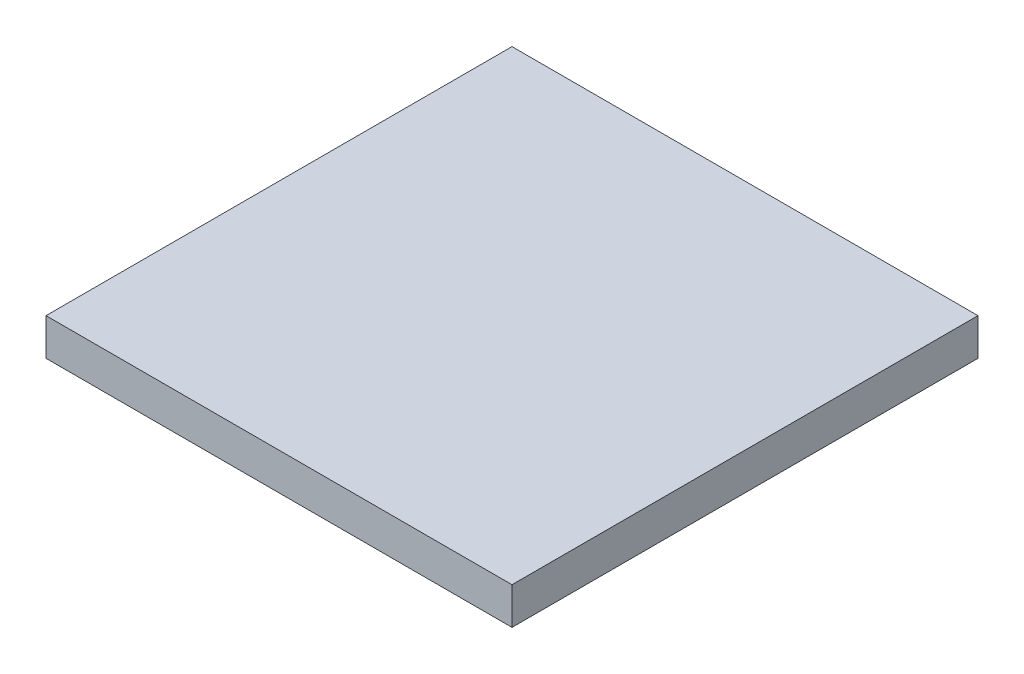
ISO-10303-21;
HEADER;
FILE_DESCRIPTION(('STEP AP214'),'2;1');
FILE_NAME('part.step','',(''),(''),'','','');
FILE_SCHEMA(('AUTOMOTIVE_DESIGN { 1 0 10303 214 1 1 1 1 }'));
ENDSEC;
DATA;
#1=APPLICATION_CONTEXT('core data for automotive mechanical design processes');
#2=APPLICATION_PROTOCOL_DEFINITION('international standard','automotive_design',2000,#1);
#3=PRODUCT_CONTEXT('',#1,'mechanical');
#4=PRODUCT('Part','Part','',(#3));
#5=PRODUCT_RELATED_PRODUCT_CATEGORY('part','',(#4));
#6=PRODUCT_DEFINITION_FORMATION('','',#4);
#7=PRODUCT_DEFINITION_CONTEXT('part definition',#1,'design');
#8=PRODUCT_DEFINITION('design','',#6,#7);
#9=PRODUCT_DEFINITION_SHAPE('','',#8);
#10=(LENGTH_UNIT() NAMED_UNIT(*) SI_UNIT(.MILLI.,.METRE.));
#11=(NAMED_UNIT(*) PLANE_ANGLE_UNIT() SI_UNIT($,.RADIAN.));
#12=(NAMED_UNIT(*) SI_UNIT($,.STERADIAN.) SOLID_ANGLE_UNIT());
#13=UNCERTAINTY_MEASURE_WITH_UNIT(LENGTH_MEASURE(1.E-05),#10,'distance_accuracy_value','');
#14=(GEOMETRIC_REPRESENTATION_CONTEXT(3) GLOBAL_UNCERTAINTY_ASSIGNED_CONTEXT((#13)) GLOBAL_UNIT_ASSIGNED_CONTEXT((#10,
#11,#12)) REPRESENTATION_CONTEXT('',''));
#15=CARTESIAN_POINT('',(0.,0.,0.));
#16=DIRECTION('',(0.,0.,1.));
#17=DIRECTION('',(1.,0.,0.));
#18=AXIS2_PLACEMENT_3D('',#15,#16,#17);
#19=CARTESIAN_POINT('',(0.,6.35,0.));
#20=DIRECTION('',(1.,0.,0.));
#21=DIRECTION('',(0.,0.,-1.));
#22=AXIS2_PLACEMENT_3D('',#19,#20,#21);
#23=PLANE('',#22);
#24=DIRECTION('',(0.,0.,1.));
#25=VECTOR('',#24,1.);
#26=CARTESIAN_POINT('',(0.,0.,0.));
#27=LINE('',#26,#25);
#28=CARTESIAN_POINT('',(0.,0.,0.));
#29=VERTEX_POINT('',#28);
#30=CARTESIAN_POINT('',(0.,0.,80.01));
#31=VERTEX_POINT('',#30);
#32=EDGE_CURVE('E96',#29,#31,#27,.T.);
#33=ORIENTED_EDGE('',*,*,#32,.T.);
#34=DIRECTION('',(0.,-1.,0.));
#35=VECTOR('',#34,1.);
#36=CARTESIAN_POINT('',(0.,6.35,80.01));
#37=LINE('',#36,#35);
#38=CARTESIAN_POINT('',(0.,6.35,80.01));
#39=VERTEX_POINT('',#38);
#40=EDGE_CURVE('E11',#39,#31,#37,.T.);
#41=ORIENTED_EDGE('',*,*,#40,.F.);
#42=DIRECTION('',(0.,0.,1.));
#43=VECTOR('',#42,1.);
#44=CARTESIAN_POINT('',(0.,6.35,0.));
#45=LINE('',#44,#43);
#46=CARTESIAN_POINT('',(0.,6.35,0.));
#47=VERTEX_POINT('',#46);
#48=EDGE_CURVE('E84',#47,#39,#45,.T.);
#49=ORIENTED_EDGE('',*,*,#48,.F.);
#50=DIRECTION('',(0.,-1.,0.));
#51=VECTOR('',#50,1.);
#52=CARTESIAN_POINT('',(0.,6.35,0.));
#53=LINE('',#52,#51);
#54=EDGE_CURVE('E92',#47,#29,#53,.T.);
#55=ORIENTED_EDGE('',*,*,#54,.T.);
#56=EDGE_LOOP('',(#33,#41,#49,#55));
#57=FACE_BOUND('',#56,.T.);
#58=ADVANCED_FACE('F33',(#57),#23,.F.);
#59=CARTESIAN_POINT('',(0.,6.35,80.01));
#60=DIRECTION('',(0.,0.,-1.));
#61=DIRECTION('',(-1.,0.,0.));
#62=AXIS2_PLACEMENT_3D('',#59,#60,#61);
#63=PLANE('',#62);
#64=DIRECTION('',(1.,0.,0.));
#65=VECTOR('',#64,1.);
#66=CARTESIAN_POINT('',(0.,0.,80.01));
#67=LINE('',#66,#65);
#68=CARTESIAN_POINT('',(80.01,0.,80.01));
#69=VERTEX_POINT('',#68);
#70=EDGE_CURVE('E88',#31,#69,#67,.T.);
#71=ORIENTED_EDGE('',*,*,#70,.T.);
#72=DIRECTION('',(0.,-1.,0.));
#73=VECTOR('',#72,1.);
#74=CARTESIAN_POINT('',(80.01,6.35,80.01));
#75=LINE('',#74,#73);
#76=CARTESIAN_POINT('',(80.01,6.35,80.01));
#77=VERTEX_POINT('',#76);
#78=EDGE_CURVE('E41',#77,#69,#75,.T.);
#79=ORIENTED_EDGE('',*,*,#78,.F.);
#80=DIRECTION('',(1.,0.,0.));
#81=VECTOR('',#80,1.);
#82=CARTESIAN_POINT('',(0.,6.35,80.01));
#83=LINE('',#82,#81);
#84=EDGE_CURVE('E79',#39,#77,#83,.T.);
#85=ORIENTED_EDGE('',*,*,#84,.F.);
#86=ORIENTED_EDGE('',*,*,#40,.T.);
#87=EDGE_LOOP('',(#71,#79,#85,#86));
#88=FACE_BOUND('',#87,.T.);
#89=ADVANCED_FACE('F87',(#88),#63,.F.);
#90=CARTESIAN_POINT('',(80.01,6.35,0.));
#91=DIRECTION('',(-1.,0.,0.));
#92=DIRECTION('',(0.,0.,1.));
#93=AXIS2_PLACEMENT_3D('',#90,#91,#92);
#94=PLANE('',#93);
#95=DIRECTION('',(0.,0.,-1.));
#96=VECTOR('',#95,1.);
#97=CARTESIAN_POINT('',(80.01,0.,0.));
#98=LINE('',#97,#96);
#99=CARTESIAN_POINT('',(80.01,0.,0.));
#100=VERTEX_POINT('',#99);
#101=EDGE_CURVE('E66',#69,#100,#98,.T.);
#102=ORIENTED_EDGE('',*,*,#101,.T.);
#103=DIRECTION('',(0.,-1.,0.));
#104=VECTOR('',#103,1.);
#105=CARTESIAN_POINT('',(80.01,6.35,0.));
#106=LINE('',#105,#104);
#107=CARTESIAN_POINT('',(80.01,6.35,0.));
#108=VERTEX_POINT('',#107);
#109=EDGE_CURVE('E89',#108,#100,#106,.T.);
#110=ORIENTED_EDGE('',*,*,#109,.F.);
#111=DIRECTION('',(0.,0.,-1.));
#112=VECTOR('',#111,1.);
#113=CARTESIAN_POINT('',(80.01,6.35,0.));
#114=LINE('',#113,#112);
#115=EDGE_CURVE('E82',#77,#108,#114,.T.);
#116=ORIENTED_EDGE('',*,*,#115,.F.);
#117=ORIENTED_EDGE('',*,*,#78,.T.);
#118=EDGE_LOOP('',(#102,#110,#116,#117));
#119=FACE_BOUND('',#118,.T.);
#120=ADVANCED_FACE('F90',(#119),#94,.F.);
#121=CARTESIAN_POINT('',(0.,6.35,0.));
#122=DIRECTION('',(0.,0.,1.));
#123=DIRECTION('',(1.,0.,0.));
#124=AXIS2_PLACEMENT_3D('',#121,#122,#123);
#125=PLANE('',#124);
#126=DIRECTION('',(-1.,0.,0.));
#127=VECTOR('',#126,1.);
#128=CARTESIAN_POINT('',(0.,0.,0.));
#129=LINE('',#128,#127);
#130=EDGE_CURVE('E72',#100,#29,#129,.T.);
#131=ORIENTED_EDGE('',*,*,#130,.T.);
#132=ORIENTED_EDGE('',*,*,#54,.F.);
#133=DIRECTION('',(-1.,0.,0.));
#134=VECTOR('',#133,1.);
#135=CARTESIAN_POINT('',(0.,6.35,0.));
#136=LINE('',#135,#134);
#137=EDGE_CURVE('E49',#108,#47,#136,.T.);
#138=ORIENTED_EDGE('',*,*,#137,.F.);
#139=ORIENTED_EDGE('',*,*,#109,.T.);
#140=EDGE_LOOP('',(#131,#132,#138,#139));
#141=FACE_BOUND('',#140,.T.);
#142=ADVANCED_FACE('F103',(#141),#125,.F.);
#143=CARTESIAN_POINT('',(0.,6.35,0.));
#144=DIRECTION('',(0.,1.,0.));
#145=DIRECTION('',(0.,0.,1.));
#146=AXIS2_PLACEMENT_3D('',#143,#144,#145);
#147=PLANE('',#146);
#148=ORIENTED_EDGE('',*,*,#48,.T.);
#149=ORIENTED_EDGE('',*,*,#84,.T.);
#150=ORIENTED_EDGE('',*,*,#115,.T.);
#151=ORIENTED_EDGE('',*,*,#137,.T.);
#152=EDGE_LOOP('',(#148,#149,#150,#151));
#153=FACE_BOUND('',#152,.T.);
#154=ADVANCED_FACE('F80',(#153),#147,.T.);
#155=CARTESIAN_POINT('',(0.,0.,0.));
#156=DIRECTION('',(0.,1.,0.));
#157=DIRECTION('',(0.,0.,1.));
#158=AXIS2_PLACEMENT_3D('',#155,#156,#157);
#159=PLANE('',#158);
#160=ORIENTED_EDGE('',*,*,#32,.F.);
#161=ORIENTED_EDGE('',*,*,#130,.F.);
#162=ORIENTED_EDGE('',*,*,#101,.F.);
#163=ORIENTED_EDGE('',*,*,#70,.F.);
#164=EDGE_LOOP('',(#160,#161,#162,#163));
#165=FACE_BOUND('',#164,.T.);
#166=ADVANCED_FACE('F106',(#165),#159,.F.);
#167=CLOSED_SHELL('',(#58,#89,#120,#142,#154,#166));
#168=MANIFOLD_SOLID_BREP('B2',#167);
#169=ADVANCED_BREP_SHAPE_REPRESENTATION('',(#18,#168),#14);
#170=SHAPE_DEFINITION_REPRESENTATION(#9,#169);
ENDSEC;
END-ISO-10303-21;
